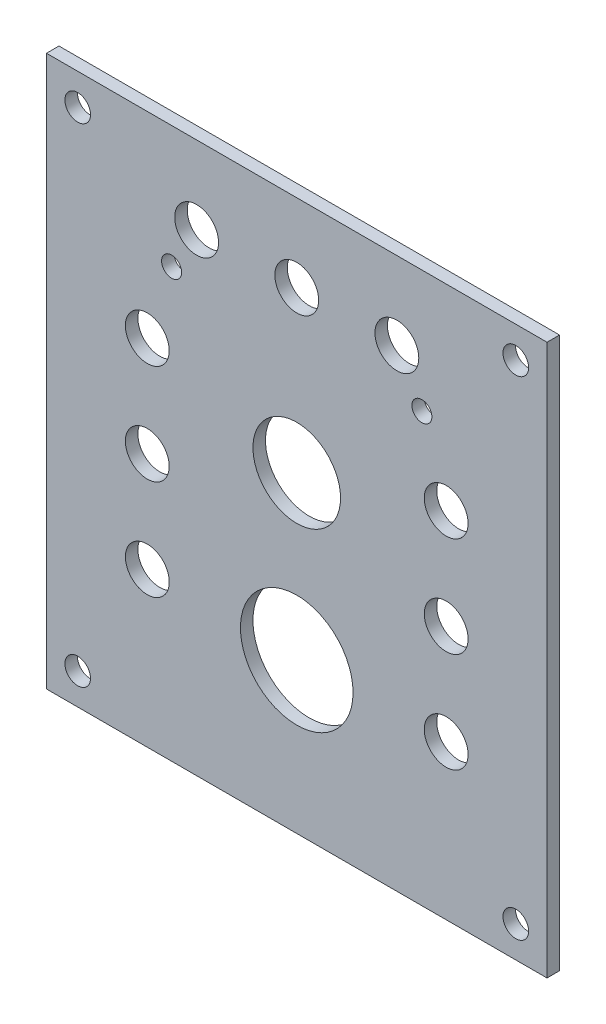
ISO-10303-21;
HEADER;
FILE_DESCRIPTION(('STEP AP214'),'2;1');
FILE_NAME('part.step','',(''),(''),'','','');
FILE_SCHEMA(('AUTOMOTIVE_DESIGN { 1 0 10303 214 1 1 1 1 }'));
ENDSEC;
DATA;
#1=APPLICATION_CONTEXT('core data for automotive mechanical design processes');
#2=APPLICATION_PROTOCOL_DEFINITION('international standard','automotive_design',2000,#1);
#3=PRODUCT_CONTEXT('',#1,'mechanical');
#4=PRODUCT('Part','Part','',(#3));
#5=PRODUCT_RELATED_PRODUCT_CATEGORY('part','',(#4));
#6=PRODUCT_DEFINITION_FORMATION('','',#4);
#7=PRODUCT_DEFINITION_CONTEXT('part definition',#1,'design');
#8=PRODUCT_DEFINITION('design','',#6,#7);
#9=PRODUCT_DEFINITION_SHAPE('','',#8);
#10=(LENGTH_UNIT() NAMED_UNIT(*) SI_UNIT(.MILLI.,.METRE.));
#11=(NAMED_UNIT(*) PLANE_ANGLE_UNIT() SI_UNIT($,.RADIAN.));
#12=(NAMED_UNIT(*) SI_UNIT($,.STERADIAN.) SOLID_ANGLE_UNIT());
#13=UNCERTAINTY_MEASURE_WITH_UNIT(LENGTH_MEASURE(1.E-05),#10,'distance_accuracy_value','');
#14=(GEOMETRIC_REPRESENTATION_CONTEXT(3) GLOBAL_UNCERTAINTY_ASSIGNED_CONTEXT((#13)) GLOBAL_UNIT_ASSIGNED_CONTEXT((#10,
#11,#12)) REPRESENTATION_CONTEXT('',''));
#15=CARTESIAN_POINT('',(0.,0.,0.));
#16=DIRECTION('',(0.,0.,1.));
#17=DIRECTION('',(1.,0.,0.));
#18=AXIS2_PLACEMENT_3D('',#15,#16,#17);
#19=CARTESIAN_POINT('',(63.5,101.6,-3.175));
#20=DIRECTION('',(0.,0.,-1.));
#21=DIRECTION('',(-1.,0.,0.));
#22=AXIS2_PLACEMENT_3D('',#19,#20,#21);
#23=PLANE('',#22);
#24=CARTESIAN_POINT('',(-55.5752000000001,-30.1752,-3.175));
#25=DIRECTION('',(0.,0.,1.));
#26=DIRECTION('',(1.,0.,0.));
#27=AXIS2_PLACEMENT_3D('',#24,#25,#26);
#28=CIRCLE('',#27,3.2512);
#29=CARTESIAN_POINT('',(-52.3240000000001,-30.1752,-3.175));
#30=VERTEX_POINT('',#29);
#31=EDGE_CURVE('E129',#30,#30,#28,.T.);
#32=ORIENTED_EDGE('',*,*,#31,.T.);
#33=EDGE_LOOP('',(#32));
#34=FACE_BOUND('',#33,.T.);
#35=CARTESIAN_POINT('',(0.,81.8388,-3.175));
#36=DIRECTION('',(0.,0.,1.));
#37=DIRECTION('',(1.,0.,0.));
#38=AXIS2_PLACEMENT_3D('',#35,#36,#37);
#39=CIRCLE('',#38,5.5626);
#40=CARTESIAN_POINT('',(5.5626,81.8388,-3.175));
#41=VERTEX_POINT('',#40);
#42=EDGE_CURVE('E132',#41,#41,#39,.T.);
#43=ORIENTED_EDGE('',*,*,#42,.T.);
#44=EDGE_LOOP('',(#43));
#45=FACE_BOUND('',#44,.T.);
#46=CARTESIAN_POINT('',(-37.9152217386642,51.7771785892618,-3.175));
#47=DIRECTION('',(0.,0.,1.));
#48=DIRECTION('',(1.,0.,0.));
#49=AXIS2_PLACEMENT_3D('',#46,#47,#48);
#50=CIRCLE('',#49,5.5626);
#51=CARTESIAN_POINT('',(-32.3526217386642,51.7771785892618,-3.175));
#52=VERTEX_POINT('',#51);
#53=EDGE_CURVE('E135',#52,#52,#50,.T.);
#54=ORIENTED_EDGE('',*,*,#53,.T.);
#55=EDGE_LOOP('',(#54));
#56=FACE_BOUND('',#55,.T.);
#57=CARTESIAN_POINT('',(37.9152217386642,0.977178589261784,-3.175));
#58=DIRECTION('',(0.,0.,1.));
#59=DIRECTION('',(1.,0.,0.));
#60=AXIS2_PLACEMENT_3D('',#57,#58,#59);
#61=CIRCLE('',#60,5.5626);
#62=CARTESIAN_POINT('',(43.4778217386642,0.977178589261784,-3.175));
#63=VERTEX_POINT('',#62);
#64=EDGE_CURVE('E138',#63,#63,#61,.T.);
#65=ORIENTED_EDGE('',*,*,#64,.T.);
#66=EDGE_LOOP('',(#65));
#67=FACE_BOUND('',#66,.T.);
#68=CARTESIAN_POINT('',(25.4,81.8388,-3.175));
#69=DIRECTION('',(0.,0.,1.));
#70=DIRECTION('',(1.,0.,0.));
#71=AXIS2_PLACEMENT_3D('',#68,#69,#70);
#72=CIRCLE('',#71,5.5626);
#73=CARTESIAN_POINT('',(30.9626,81.8388,-3.175));
#74=VERTEX_POINT('',#73);
#75=EDGE_CURVE('E141',#74,#74,#72,.T.);
#76=ORIENTED_EDGE('',*,*,#75,.T.);
#77=EDGE_LOOP('',(#76));
#78=FACE_BOUND('',#77,.T.);
#79=CARTESIAN_POINT('',(0.,41.148,-3.175));
#80=DIRECTION('',(0.,0.,1.));
#81=DIRECTION('',(1.,0.,0.));
#82=AXIS2_PLACEMENT_3D('',#79,#80,#81);
#83=CIRCLE('',#82,11.1125);
#84=CARTESIAN_POINT('',(11.1125,41.148,-3.175));
#85=VERTEX_POINT('',#84);
#86=EDGE_CURVE('E144',#85,#85,#83,.T.);
#87=ORIENTED_EDGE('',*,*,#86,.T.);
#88=EDGE_LOOP('',(#87));
#89=FACE_BOUND('',#88,.T.);
#90=CARTESIAN_POINT('',(55.5752,93.6752,-3.175));
#91=DIRECTION('',(0.,0.,1.));
#92=DIRECTION('',(1.,0.,0.));
#93=AXIS2_PLACEMENT_3D('',#90,#91,#92);
#94=CIRCLE('',#93,3.25119999999999);
#95=CARTESIAN_POINT('',(58.8264,93.6752,-3.175));
#96=VERTEX_POINT('',#95);
#97=EDGE_CURVE('E147',#96,#96,#94,.T.);
#98=ORIENTED_EDGE('',*,*,#97,.T.);
#99=EDGE_LOOP('',(#98));
#100=FACE_BOUND('',#99,.T.);
#101=CARTESIAN_POINT('',(55.5752,-30.1752,-3.175));
#102=DIRECTION('',(0.,0.,1.));
#103=DIRECTION('',(1.,0.,0.));
#104=AXIS2_PLACEMENT_3D('',#101,#102,#103);
#105=CIRCLE('',#104,3.2512);
#106=CARTESIAN_POINT('',(58.8264,-30.1752,-3.175));
#107=VERTEX_POINT('',#106);
#108=EDGE_CURVE('E150',#107,#107,#105,.T.);
#109=ORIENTED_EDGE('',*,*,#108,.T.);
#110=EDGE_LOOP('',(#109));
#111=FACE_BOUND('',#110,.T.);
#112=DIRECTION('',(-1.,0.,0.));
#113=VECTOR('',#112,1.);
#114=CARTESIAN_POINT('',(63.5,-38.1,-3.175));
#115=LINE('',#114,#113);
#116=CARTESIAN_POINT('',(63.5,-38.1,-3.175));
#117=VERTEX_POINT('',#116);
#118=CARTESIAN_POINT('',(-63.5,-38.1,-3.175));
#119=VERTEX_POINT('',#118);
#120=EDGE_CURVE('E55',#117,#119,#115,.T.);
#121=ORIENTED_EDGE('',*,*,#120,.T.);
#122=DIRECTION('',(0.,1.,0.));
#123=VECTOR('',#122,1.);
#124=CARTESIAN_POINT('',(-63.5,-38.1,-3.175));
#125=LINE('',#124,#123);
#126=CARTESIAN_POINT('',(-63.5,101.6,-3.175));
#127=VERTEX_POINT('',#126);
#128=EDGE_CURVE('E481',#119,#127,#125,.T.);
#129=ORIENTED_EDGE('',*,*,#128,.T.);
#130=DIRECTION('',(1.,0.,0.));
#131=VECTOR('',#130,1.);
#132=CARTESIAN_POINT('',(-63.5,101.6,-3.175));
#133=LINE('',#132,#131);
#134=CARTESIAN_POINT('',(63.5,101.6,-3.175));
#135=VERTEX_POINT('',#134);
#136=EDGE_CURVE('E60',#127,#135,#133,.T.);
#137=ORIENTED_EDGE('',*,*,#136,.T.);
#138=DIRECTION('',(0.,-1.,0.));
#139=VECTOR('',#138,1.);
#140=CARTESIAN_POINT('',(63.5,101.6,-3.175));
#141=LINE('',#140,#139);
#142=EDGE_CURVE('E58',#135,#117,#141,.T.);
#143=ORIENTED_EDGE('',*,*,#142,.T.);
#144=EDGE_LOOP('',(#121,#129,#137,#143));
#145=FACE_BOUND('',#144,.T.);
#146=CARTESIAN_POINT('',(-55.5752,93.6752,-3.175));
#147=DIRECTION('',(0.,0.,1.));
#148=DIRECTION('',(1.,0.,0.));
#149=AXIS2_PLACEMENT_3D('',#146,#147,#148);
#150=CIRCLE('',#149,3.2512);
#151=CARTESIAN_POINT('',(-52.324,93.6752,-3.175));
#152=VERTEX_POINT('',#151);
#153=EDGE_CURVE('E66',#152,#152,#150,.T.);
#154=ORIENTED_EDGE('',*,*,#153,.T.);
#155=EDGE_LOOP('',(#154));
#156=FACE_BOUND('',#155,.T.);
#157=CARTESIAN_POINT('',(0.,0.,-3.175));
#158=DIRECTION('',(0.,0.,1.));
#159=DIRECTION('',(1.,0.,0.));
#160=AXIS2_PLACEMENT_3D('',#157,#158,#159);
#161=CIRCLE('',#160,14.2875);
#162=CARTESIAN_POINT('',(14.2875,0.,-3.175));
#163=VERTEX_POINT('',#162);
#164=EDGE_CURVE('E156',#163,#163,#161,.T.);
#165=ORIENTED_EDGE('',*,*,#164,.T.);
#166=EDGE_LOOP('',(#165));
#167=FACE_BOUND('',#166,.T.);
#168=CARTESIAN_POINT('',(-25.4,81.8388,-3.175));
#169=DIRECTION('',(0.,0.,1.));
#170=DIRECTION('',(1.,0.,0.));
#171=AXIS2_PLACEMENT_3D('',#168,#169,#170);
#172=CIRCLE('',#171,5.5626);
#173=CARTESIAN_POINT('',(-19.8374,81.8388,-3.175));
#174=VERTEX_POINT('',#173);
#175=EDGE_CURVE('E159',#174,#174,#172,.T.);
#176=ORIENTED_EDGE('',*,*,#175,.T.);
#177=EDGE_LOOP('',(#176));
#178=FACE_BOUND('',#177,.T.);
#179=CARTESIAN_POINT('',(37.9152217386642,51.7771785892618,-3.175));
#180=DIRECTION('',(0.,0.,1.));
#181=DIRECTION('',(1.,0.,0.));
#182=AXIS2_PLACEMENT_3D('',#179,#180,#181);
#183=CIRCLE('',#182,5.56260000000001);
#184=CARTESIAN_POINT('',(43.4778217386643,51.7771785892618,-3.175));
#185=VERTEX_POINT('',#184);
#186=EDGE_CURVE('E162',#185,#185,#183,.T.);
#187=ORIENTED_EDGE('',*,*,#186,.T.);
#188=EDGE_LOOP('',(#187));
#189=FACE_BOUND('',#188,.T.);
#190=CARTESIAN_POINT('',(-37.9152217386642,0.977178589261808,-3.175));
#191=DIRECTION('',(0.,0.,1.));
#192=DIRECTION('',(1.,0.,0.));
#193=AXIS2_PLACEMENT_3D('',#190,#191,#192);
#194=CIRCLE('',#193,5.5626);
#195=CARTESIAN_POINT('',(-32.3526217386642,0.977178589261808,-3.175));
#196=VERTEX_POINT('',#195);
#197=EDGE_CURVE('E165',#196,#196,#194,.T.);
#198=ORIENTED_EDGE('',*,*,#197,.T.);
#199=EDGE_LOOP('',(#198));
#200=FACE_BOUND('',#199,.T.);
#201=CARTESIAN_POINT('',(-37.9152217386642,26.3771785892618,-3.175));
#202=DIRECTION('',(0.,0.,1.));
#203=DIRECTION('',(1.,0.,0.));
#204=AXIS2_PLACEMENT_3D('',#201,#202,#203);
#205=CIRCLE('',#204,5.5626);
#206=CARTESIAN_POINT('',(-32.3526217386642,26.3771785892618,-3.175));
#207=VERTEX_POINT('',#206);
#208=EDGE_CURVE('E168',#207,#207,#205,.T.);
#209=ORIENTED_EDGE('',*,*,#208,.T.);
#210=EDGE_LOOP('',(#209));
#211=FACE_BOUND('',#210,.T.);
#212=CARTESIAN_POINT('',(37.9152217386642,26.3771785892618,-3.175));
#213=DIRECTION('',(0.,0.,1.));
#214=DIRECTION('',(1.,0.,0.));
#215=AXIS2_PLACEMENT_3D('',#212,#213,#214);
#216=CIRCLE('',#215,5.5626);
#217=CARTESIAN_POINT('',(43.4778217386642,26.3771785892618,-3.175));
#218=VERTEX_POINT('',#217);
#219=EDGE_CURVE('E171',#218,#218,#216,.T.);
#220=ORIENTED_EDGE('',*,*,#219,.T.);
#221=EDGE_LOOP('',(#220));
#222=FACE_BOUND('',#221,.T.);
#223=CARTESIAN_POINT('',(-31.75,70.58025,-3.175));
#224=DIRECTION('',(0.,0.,1.));
#225=DIRECTION('',(1.,0.,0.));
#226=AXIS2_PLACEMENT_3D('',#223,#224,#225);
#227=CIRCLE('',#226,2.54);
#228=CARTESIAN_POINT('',(-29.21,70.58025,-3.175));
#229=VERTEX_POINT('',#228);
#230=EDGE_CURVE('E173',#229,#229,#227,.T.);
#231=ORIENTED_EDGE('',*,*,#230,.T.);
#232=EDGE_LOOP('',(#231));
#233=FACE_BOUND('',#232,.T.);
#234=CARTESIAN_POINT('',(31.75,70.58025,-3.175));
#235=DIRECTION('',(0.,0.,1.));
#236=DIRECTION('',(1.,0.,0.));
#237=AXIS2_PLACEMENT_3D('',#234,#235,#236);
#238=CIRCLE('',#237,2.54);
#239=CARTESIAN_POINT('',(34.29,70.58025,-3.175));
#240=VERTEX_POINT('',#239);
#241=EDGE_CURVE('E19',#240,#240,#238,.T.);
#242=ORIENTED_EDGE('',*,*,#241,.T.);
#243=EDGE_LOOP('',(#242));
#244=FACE_BOUND('',#243,.T.);
#245=ADVANCED_FACE('F16',(#34,#45,#56,#67,#78,#89,#100,#111,#145,#156,#167,#178,#189,#200,#211,
#222,#233,#244),#23,.T.);
#246=CARTESIAN_POINT('',(31.75,70.58025,-3.175));
#247=DIRECTION('',(0.,0.,1.));
#248=DIRECTION('',(1.,0.,0.));
#249=AXIS2_PLACEMENT_3D('',#246,#247,#248);
#250=CYLINDRICAL_SURFACE('',#249,2.54);
#251=ORIENTED_EDGE('',*,*,#241,.F.);
#252=EDGE_LOOP('',(#251));
#253=FACE_BOUND('',#252,.T.);
#254=CARTESIAN_POINT('',(31.75,70.58025,0.));
#255=DIRECTION('',(0.,0.,1.));
#256=DIRECTION('',(1.,0.,0.));
#257=AXIS2_PLACEMENT_3D('',#254,#255,#256);
#258=CIRCLE('',#257,2.54);
#259=CARTESIAN_POINT('',(34.29,70.58025,0.));
#260=VERTEX_POINT('',#259);
#261=EDGE_CURVE('E126',#260,#260,#258,.T.);
#262=ORIENTED_EDGE('',*,*,#261,.T.);
#263=EDGE_LOOP('',(#262));
#264=FACE_BOUND('',#263,.T.);
#265=ADVANCED_FACE('F181',(#253,#264),#250,.F.);
#266=CARTESIAN_POINT('',(-31.75,70.58025,-3.175));
#267=DIRECTION('',(0.,0.,1.));
#268=DIRECTION('',(1.,0.,0.));
#269=AXIS2_PLACEMENT_3D('',#266,#267,#268);
#270=CYLINDRICAL_SURFACE('',#269,2.54);
#271=ORIENTED_EDGE('',*,*,#230,.F.);
#272=EDGE_LOOP('',(#271));
#273=FACE_BOUND('',#272,.T.);
#274=CARTESIAN_POINT('',(-31.75,70.58025,0.));
#275=DIRECTION('',(0.,0.,1.));
#276=DIRECTION('',(1.,0.,0.));
#277=AXIS2_PLACEMENT_3D('',#274,#275,#276);
#278=CIRCLE('',#277,2.54);
#279=CARTESIAN_POINT('',(-29.21,70.58025,0.));
#280=VERTEX_POINT('',#279);
#281=EDGE_CURVE('E123',#280,#280,#278,.T.);
#282=ORIENTED_EDGE('',*,*,#281,.T.);
#283=EDGE_LOOP('',(#282));
#284=FACE_BOUND('',#283,.T.);
#285=ADVANCED_FACE('F184',(#273,#284),#270,.F.);
#286=CARTESIAN_POINT('',(37.9152217386642,26.3771785892618,-3.175));
#287=DIRECTION('',(0.,0.,1.));
#288=DIRECTION('',(1.,0.,0.));
#289=AXIS2_PLACEMENT_3D('',#286,#287,#288);
#290=CYLINDRICAL_SURFACE('',#289,5.5626);
#291=CARTESIAN_POINT('',(37.9152217386642,26.3771785892618,0.));
#292=DIRECTION('',(0.,0.,1.));
#293=DIRECTION('',(1.,0.,0.));
#294=AXIS2_PLACEMENT_3D('',#291,#292,#293);
#295=CIRCLE('',#294,5.5626);
#296=CARTESIAN_POINT('',(43.4778217386642,26.3771785892618,0.));
#297=VERTEX_POINT('',#296);
#298=EDGE_CURVE('E120',#297,#297,#295,.T.);
#299=ORIENTED_EDGE('',*,*,#298,.T.);
#300=EDGE_LOOP('',(#299));
#301=FACE_BOUND('',#300,.T.);
#302=ORIENTED_EDGE('',*,*,#219,.F.);
#303=EDGE_LOOP('',(#302));
#304=FACE_BOUND('',#303,.T.);
#305=ADVANCED_FACE('F263',(#301,#304),#290,.F.);
#306=CARTESIAN_POINT('',(-37.9152217386642,26.3771785892618,-3.175));
#307=DIRECTION('',(0.,0.,1.));
#308=DIRECTION('',(1.,0.,0.));
#309=AXIS2_PLACEMENT_3D('',#306,#307,#308);
#310=CYLINDRICAL_SURFACE('',#309,5.5626);
#311=CARTESIAN_POINT('',(-37.9152217386642,26.3771785892618,0.));
#312=DIRECTION('',(0.,0.,1.));
#313=DIRECTION('',(1.,0.,0.));
#314=AXIS2_PLACEMENT_3D('',#311,#312,#313);
#315=CIRCLE('',#314,5.5626);
#316=CARTESIAN_POINT('',(-32.3526217386642,26.3771785892618,0.));
#317=VERTEX_POINT('',#316);
#318=EDGE_CURVE('E117',#317,#317,#315,.T.);
#319=ORIENTED_EDGE('',*,*,#318,.T.);
#320=EDGE_LOOP('',(#319));
#321=FACE_BOUND('',#320,.T.);
#322=ORIENTED_EDGE('',*,*,#208,.F.);
#323=EDGE_LOOP('',(#322));
#324=FACE_BOUND('',#323,.T.);
#325=ADVANCED_FACE('F259',(#321,#324),#310,.F.);
#326=CARTESIAN_POINT('',(-37.9152217386642,0.977178589261808,-3.175));
#327=DIRECTION('',(0.,0.,1.));
#328=DIRECTION('',(1.,0.,0.));
#329=AXIS2_PLACEMENT_3D('',#326,#327,#328);
#330=CYLINDRICAL_SURFACE('',#329,5.5626);
#331=CARTESIAN_POINT('',(-37.9152217386642,0.977178589261808,0.));
#332=DIRECTION('',(0.,0.,1.));
#333=DIRECTION('',(1.,0.,0.));
#334=AXIS2_PLACEMENT_3D('',#331,#332,#333);
#335=CIRCLE('',#334,5.5626);
#336=CARTESIAN_POINT('',(-32.3526217386642,0.977178589261808,0.));
#337=VERTEX_POINT('',#336);
#338=EDGE_CURVE('E114',#337,#337,#335,.T.);
#339=ORIENTED_EDGE('',*,*,#338,.T.);
#340=EDGE_LOOP('',(#339));
#341=FACE_BOUND('',#340,.T.);
#342=ORIENTED_EDGE('',*,*,#197,.F.);
#343=EDGE_LOOP('',(#342));
#344=FACE_BOUND('',#343,.T.);
#345=ADVANCED_FACE('F255',(#341,#344),#330,.F.);
#346=CARTESIAN_POINT('',(37.9152217386642,51.7771785892618,-3.175));
#347=DIRECTION('',(0.,0.,1.));
#348=DIRECTION('',(1.,0.,0.));
#349=AXIS2_PLACEMENT_3D('',#346,#347,#348);
#350=CYLINDRICAL_SURFACE('',#349,5.56260000000001);
#351=CARTESIAN_POINT('',(37.9152217386642,51.7771785892618,0.));
#352=DIRECTION('',(0.,0.,1.));
#353=DIRECTION('',(1.,0.,0.));
#354=AXIS2_PLACEMENT_3D('',#351,#352,#353);
#355=CIRCLE('',#354,5.56260000000001);
#356=CARTESIAN_POINT('',(43.4778217386643,51.7771785892618,0.));
#357=VERTEX_POINT('',#356);
#358=EDGE_CURVE('E111',#357,#357,#355,.T.);
#359=ORIENTED_EDGE('',*,*,#358,.T.);
#360=EDGE_LOOP('',(#359));
#361=FACE_BOUND('',#360,.T.);
#362=ORIENTED_EDGE('',*,*,#186,.F.);
#363=EDGE_LOOP('',(#362));
#364=FACE_BOUND('',#363,.T.);
#365=ADVANCED_FACE('F251',(#361,#364),#350,.F.);
#366=CARTESIAN_POINT('',(-25.4,81.8388,-3.175));
#367=DIRECTION('',(0.,0.,1.));
#368=DIRECTION('',(1.,0.,0.));
#369=AXIS2_PLACEMENT_3D('',#366,#367,#368);
#370=CYLINDRICAL_SURFACE('',#369,5.5626);
#371=CARTESIAN_POINT('',(-25.4,81.8388,0.));
#372=DIRECTION('',(0.,0.,1.));
#373=DIRECTION('',(1.,0.,0.));
#374=AXIS2_PLACEMENT_3D('',#371,#372,#373);
#375=CIRCLE('',#374,5.5626);
#376=CARTESIAN_POINT('',(-19.8374,81.8388,0.));
#377=VERTEX_POINT('',#376);
#378=EDGE_CURVE('E108',#377,#377,#375,.T.);
#379=ORIENTED_EDGE('',*,*,#378,.T.);
#380=EDGE_LOOP('',(#379));
#381=FACE_BOUND('',#380,.T.);
#382=ORIENTED_EDGE('',*,*,#175,.F.);
#383=EDGE_LOOP('',(#382));
#384=FACE_BOUND('',#383,.T.);
#385=ADVANCED_FACE('F247',(#381,#384),#370,.F.);
#386=CARTESIAN_POINT('',(0.,0.,-3.175));
#387=DIRECTION('',(0.,0.,1.));
#388=DIRECTION('',(1.,0.,0.));
#389=AXIS2_PLACEMENT_3D('',#386,#387,#388);
#390=CYLINDRICAL_SURFACE('',#389,14.2875);
#391=CARTESIAN_POINT('',(0.,0.,0.));
#392=DIRECTION('',(0.,0.,1.));
#393=DIRECTION('',(1.,0.,0.));
#394=AXIS2_PLACEMENT_3D('',#391,#392,#393);
#395=CIRCLE('',#394,14.2875);
#396=CARTESIAN_POINT('',(14.2875,0.,0.));
#397=VERTEX_POINT('',#396);
#398=EDGE_CURVE('E105',#397,#397,#395,.T.);
#399=ORIENTED_EDGE('',*,*,#398,.T.);
#400=EDGE_LOOP('',(#399));
#401=FACE_BOUND('',#400,.T.);
#402=ORIENTED_EDGE('',*,*,#164,.F.);
#403=EDGE_LOOP('',(#402));
#404=FACE_BOUND('',#403,.T.);
#405=ADVANCED_FACE('F243',(#401,#404),#390,.F.);
#406=CARTESIAN_POINT('',(-55.5752,93.6752,-3.175));
#407=DIRECTION('',(0.,0.,1.));
#408=DIRECTION('',(1.,0.,0.));
#409=AXIS2_PLACEMENT_3D('',#406,#407,#408);
#410=CYLINDRICAL_SURFACE('',#409,3.2512);
#411=CARTESIAN_POINT('',(-55.5752,93.6752,0.));
#412=DIRECTION('',(0.,0.,1.));
#413=DIRECTION('',(1.,0.,0.));
#414=AXIS2_PLACEMENT_3D('',#411,#412,#413);
#415=CIRCLE('',#414,3.2512);
#416=CARTESIAN_POINT('',(-52.324,93.6752,0.));
#417=VERTEX_POINT('',#416);
#418=EDGE_CURVE('E102',#417,#417,#415,.T.);
#419=ORIENTED_EDGE('',*,*,#418,.T.);
#420=EDGE_LOOP('',(#419));
#421=FACE_BOUND('',#420,.T.);
#422=ORIENTED_EDGE('',*,*,#153,.F.);
#423=EDGE_LOOP('',(#422));
#424=FACE_BOUND('',#423,.T.);
#425=ADVANCED_FACE('F240',(#421,#424),#410,.F.);
#426=CARTESIAN_POINT('',(63.5,101.6,-3.175));
#427=DIRECTION('',(-1.,0.,0.));
#428=DIRECTION('',(0.,-1.,0.));
#429=AXIS2_PLACEMENT_3D('',#426,#427,#428);
#430=PLANE('',#429);
#431=DIRECTION('',(0.,0.,1.));
#432=VECTOR('',#431,1.);
#433=CARTESIAN_POINT('',(63.5,-38.1,-3.175));
#434=LINE('',#433,#432);
#435=CARTESIAN_POINT('',(63.5,-38.1,0.));
#436=VERTEX_POINT('',#435);
#437=EDGE_CURVE('E65',#436,#117,#434,.F.);
#438=ORIENTED_EDGE('',*,*,#437,.T.);
#439=ORIENTED_EDGE('',*,*,#142,.F.);
#440=DIRECTION('',(0.,0.,1.));
#441=VECTOR('',#440,1.);
#442=CARTESIAN_POINT('',(63.5,101.6,-3.175));
#443=LINE('',#442,#441);
#444=CARTESIAN_POINT('',(63.5,101.6,0.));
#445=VERTEX_POINT('',#444);
#446=EDGE_CURVE('E153',#135,#445,#443,.T.);
#447=ORIENTED_EDGE('',*,*,#446,.T.);
#448=DIRECTION('',(0.,1.,0.));
#449=VECTOR('',#448,1.);
#450=CARTESIAN_POINT('',(63.5,101.6,0.));
#451=LINE('',#450,#449);
#452=EDGE_CURVE('E77',#445,#436,#451,.F.);
#453=ORIENTED_EDGE('',*,*,#452,.T.);
#454=EDGE_LOOP('',(#438,#439,#447,#453));
#455=FACE_BOUND('',#454,.T.);
#456=ADVANCED_FACE('F76',(#455),#430,.F.);
#457=CARTESIAN_POINT('',(63.5,-38.1,-3.175));
#458=DIRECTION('',(0.,1.,0.));
#459=DIRECTION('',(-1.,0.,0.));
#460=AXIS2_PLACEMENT_3D('',#457,#458,#459);
#461=PLANE('',#460);
#462=DIRECTION('',(0.,0.,1.));
#463=VECTOR('',#462,1.);
#464=CARTESIAN_POINT('',(-63.5,-38.1,-3.175));
#465=LINE('',#464,#463);
#466=CARTESIAN_POINT('',(-63.5,-38.1,0.));
#467=VERTEX_POINT('',#466);
#468=EDGE_CURVE('E73',#467,#119,#465,.F.);
#469=ORIENTED_EDGE('',*,*,#468,.T.);
#470=ORIENTED_EDGE('',*,*,#120,.F.);
#471=ORIENTED_EDGE('',*,*,#437,.F.);
#472=DIRECTION('',(-1.,0.,0.));
#473=VECTOR('',#472,1.);
#474=CARTESIAN_POINT('',(63.5,-38.1,0.));
#475=LINE('',#474,#473);
#476=EDGE_CURVE('E490',#436,#467,#475,.T.);
#477=ORIENTED_EDGE('',*,*,#476,.T.);
#478=EDGE_LOOP('',(#469,#470,#471,#477));
#479=FACE_BOUND('',#478,.T.);
#480=ADVANCED_FACE('F70',(#479),#461,.F.);
#481=CARTESIAN_POINT('',(-63.5,-38.1,-3.175));
#482=DIRECTION('',(1.,0.,0.));
#483=DIRECTION('',(0.,1.,0.));
#484=AXIS2_PLACEMENT_3D('',#481,#482,#483);
#485=PLANE('',#484);
#486=DIRECTION('',(0.,0.,1.));
#487=VECTOR('',#486,1.);
#488=CARTESIAN_POINT('',(-63.5,101.6,-3.175));
#489=LINE('',#488,#487);
#490=CARTESIAN_POINT('',(-63.5,101.6,0.));
#491=VERTEX_POINT('',#490);
#492=EDGE_CURVE('E34',#491,#127,#489,.F.);
#493=ORIENTED_EDGE('',*,*,#492,.T.);
#494=ORIENTED_EDGE('',*,*,#128,.F.);
#495=ORIENTED_EDGE('',*,*,#468,.F.);
#496=DIRECTION('',(0.,1.,0.));
#497=VECTOR('',#496,1.);
#498=CARTESIAN_POINT('',(-63.5,101.6,0.));
#499=LINE('',#498,#497);
#500=EDGE_CURVE('E483',#467,#491,#499,.T.);
#501=ORIENTED_EDGE('',*,*,#500,.T.);
#502=EDGE_LOOP('',(#493,#494,#495,#501));
#503=FACE_BOUND('',#502,.T.);
#504=ADVANCED_FACE('F232',(#503),#485,.F.);
#505=CARTESIAN_POINT('',(-63.5,101.6,-3.175));
#506=DIRECTION('',(0.,-1.,0.));
#507=DIRECTION('',(1.,0.,0.));
#508=AXIS2_PLACEMENT_3D('',#505,#506,#507);
#509=PLANE('',#508);
#510=ORIENTED_EDGE('',*,*,#446,.F.);
#511=ORIENTED_EDGE('',*,*,#136,.F.);
#512=ORIENTED_EDGE('',*,*,#492,.F.);
#513=DIRECTION('',(-1.,0.,0.));
#514=VECTOR('',#513,1.);
#515=CARTESIAN_POINT('',(63.5,101.6,0.));
#516=LINE('',#515,#514);
#517=EDGE_CURVE('E101',#491,#445,#516,.F.);
#518=ORIENTED_EDGE('',*,*,#517,.T.);
#519=EDGE_LOOP('',(#510,#511,#512,#518));
#520=FACE_BOUND('',#519,.T.);
#521=ADVANCED_FACE('F228',(#520),#509,.F.);
#522=CARTESIAN_POINT('',(55.5752,-30.1752,-3.175));
#523=DIRECTION('',(0.,0.,1.));
#524=DIRECTION('',(1.,0.,0.));
#525=AXIS2_PLACEMENT_3D('',#522,#523,#524);
#526=CYLINDRICAL_SURFACE('',#525,3.2512);
#527=CARTESIAN_POINT('',(55.5752,-30.1752,0.));
#528=DIRECTION('',(0.,0.,1.));
#529=DIRECTION('',(1.,0.,0.));
#530=AXIS2_PLACEMENT_3D('',#527,#528,#529);
#531=CIRCLE('',#530,3.2512);
#532=CARTESIAN_POINT('',(58.8264,-30.1752,0.));
#533=VERTEX_POINT('',#532);
#534=EDGE_CURVE('E98',#533,#533,#531,.T.);
#535=ORIENTED_EDGE('',*,*,#534,.T.);
#536=EDGE_LOOP('',(#535));
#537=FACE_BOUND('',#536,.T.);
#538=ORIENTED_EDGE('',*,*,#108,.F.);
#539=EDGE_LOOP('',(#538));
#540=FACE_BOUND('',#539,.T.);
#541=ADVANCED_FACE('F224',(#537,#540),#526,.F.);
#542=CARTESIAN_POINT('',(55.5752,93.6752,-3.175));
#543=DIRECTION('',(0.,0.,1.));
#544=DIRECTION('',(1.,0.,0.));
#545=AXIS2_PLACEMENT_3D('',#542,#543,#544);
#546=CYLINDRICAL_SURFACE('',#545,3.25119999999999);
#547=CARTESIAN_POINT('',(55.5752,93.6752,0.));
#548=DIRECTION('',(0.,0.,1.));
#549=DIRECTION('',(1.,0.,0.));
#550=AXIS2_PLACEMENT_3D('',#547,#548,#549);
#551=CIRCLE('',#550,3.25119999999999);
#552=CARTESIAN_POINT('',(58.8264,93.6752,0.));
#553=VERTEX_POINT('',#552);
#554=EDGE_CURVE('E95',#553,#553,#551,.T.);
#555=ORIENTED_EDGE('',*,*,#554,.T.);
#556=EDGE_LOOP('',(#555));
#557=FACE_BOUND('',#556,.T.);
#558=ORIENTED_EDGE('',*,*,#97,.F.);
#559=EDGE_LOOP('',(#558));
#560=FACE_BOUND('',#559,.T.);
#561=ADVANCED_FACE('F220',(#557,#560),#546,.F.);
#562=CARTESIAN_POINT('',(0.,41.148,-3.175));
#563=DIRECTION('',(0.,0.,1.));
#564=DIRECTION('',(1.,0.,0.));
#565=AXIS2_PLACEMENT_3D('',#562,#563,#564);
#566=CYLINDRICAL_SURFACE('',#565,11.1125);
#567=CARTESIAN_POINT('',(0.,41.148,0.));
#568=DIRECTION('',(0.,0.,1.));
#569=DIRECTION('',(1.,0.,0.));
#570=AXIS2_PLACEMENT_3D('',#567,#568,#569);
#571=CIRCLE('',#570,11.1125);
#572=CARTESIAN_POINT('',(11.1125,41.148,0.));
#573=VERTEX_POINT('',#572);
#574=EDGE_CURVE('E92',#573,#573,#571,.T.);
#575=ORIENTED_EDGE('',*,*,#574,.T.);
#576=EDGE_LOOP('',(#575));
#577=FACE_BOUND('',#576,.T.);
#578=ORIENTED_EDGE('',*,*,#86,.F.);
#579=EDGE_LOOP('',(#578));
#580=FACE_BOUND('',#579,.T.);
#581=ADVANCED_FACE('F216',(#577,#580),#566,.F.);
#582=CARTESIAN_POINT('',(25.4,81.8388,-3.175));
#583=DIRECTION('',(0.,0.,1.));
#584=DIRECTION('',(1.,0.,0.));
#585=AXIS2_PLACEMENT_3D('',#582,#583,#584);
#586=CYLINDRICAL_SURFACE('',#585,5.5626);
#587=CARTESIAN_POINT('',(25.4,81.8388,0.));
#588=DIRECTION('',(0.,0.,1.));
#589=DIRECTION('',(1.,0.,0.));
#590=AXIS2_PLACEMENT_3D('',#587,#588,#589);
#591=CIRCLE('',#590,5.5626);
#592=CARTESIAN_POINT('',(30.9626,81.8388,0.));
#593=VERTEX_POINT('',#592);
#594=EDGE_CURVE('E89',#593,#593,#591,.T.);
#595=ORIENTED_EDGE('',*,*,#594,.T.);
#596=EDGE_LOOP('',(#595));
#597=FACE_BOUND('',#596,.T.);
#598=ORIENTED_EDGE('',*,*,#75,.F.);
#599=EDGE_LOOP('',(#598));
#600=FACE_BOUND('',#599,.T.);
#601=ADVANCED_FACE('F212',(#597,#600),#586,.F.);
#602=CARTESIAN_POINT('',(37.9152217386642,0.977178589261784,-3.175));
#603=DIRECTION('',(0.,0.,1.));
#604=DIRECTION('',(1.,0.,0.));
#605=AXIS2_PLACEMENT_3D('',#602,#603,#604);
#606=CYLINDRICAL_SURFACE('',#605,5.5626);
#607=CARTESIAN_POINT('',(37.9152217386642,0.977178589261784,0.));
#608=DIRECTION('',(0.,0.,1.));
#609=DIRECTION('',(1.,0.,0.));
#610=AXIS2_PLACEMENT_3D('',#607,#608,#609);
#611=CIRCLE('',#610,5.5626);
#612=CARTESIAN_POINT('',(43.4778217386642,0.977178589261784,0.));
#613=VERTEX_POINT('',#612);
#614=EDGE_CURVE('E86',#613,#613,#611,.T.);
#615=ORIENTED_EDGE('',*,*,#614,.T.);
#616=EDGE_LOOP('',(#615));
#617=FACE_BOUND('',#616,.T.);
#618=ORIENTED_EDGE('',*,*,#64,.F.);
#619=EDGE_LOOP('',(#618));
#620=FACE_BOUND('',#619,.T.);
#621=ADVANCED_FACE('F208',(#617,#620),#606,.F.);
#622=CARTESIAN_POINT('',(-37.9152217386642,51.7771785892618,-3.175));
#623=DIRECTION('',(0.,0.,1.));
#624=DIRECTION('',(1.,0.,0.));
#625=AXIS2_PLACEMENT_3D('',#622,#623,#624);
#626=CYLINDRICAL_SURFACE('',#625,5.5626);
#627=CARTESIAN_POINT('',(-37.9152217386642,51.7771785892618,0.));
#628=DIRECTION('',(0.,0.,1.));
#629=DIRECTION('',(1.,0.,0.));
#630=AXIS2_PLACEMENT_3D('',#627,#628,#629);
#631=CIRCLE('',#630,5.5626);
#632=CARTESIAN_POINT('',(-32.3526217386642,51.7771785892618,0.));
#633=VERTEX_POINT('',#632);
#634=EDGE_CURVE('E83',#633,#633,#631,.T.);
#635=ORIENTED_EDGE('',*,*,#634,.T.);
#636=EDGE_LOOP('',(#635));
#637=FACE_BOUND('',#636,.T.);
#638=ORIENTED_EDGE('',*,*,#53,.F.);
#639=EDGE_LOOP('',(#638));
#640=FACE_BOUND('',#639,.T.);
#641=ADVANCED_FACE('F204',(#637,#640),#626,.F.);
#642=CARTESIAN_POINT('',(0.,81.8388,-3.175));
#643=DIRECTION('',(0.,0.,1.));
#644=DIRECTION('',(1.,0.,0.));
#645=AXIS2_PLACEMENT_3D('',#642,#643,#644);
#646=CYLINDRICAL_SURFACE('',#645,5.5626);
#647=CARTESIAN_POINT('',(0.,81.8388,0.));
#648=DIRECTION('',(0.,0.,1.));
#649=DIRECTION('',(1.,0.,0.));
#650=AXIS2_PLACEMENT_3D('',#647,#648,#649);
#651=CIRCLE('',#650,5.5626);
#652=CARTESIAN_POINT('',(5.5626,81.8388,0.));
#653=VERTEX_POINT('',#652);
#654=EDGE_CURVE('E25',#653,#653,#651,.T.);
#655=ORIENTED_EDGE('',*,*,#654,.T.);
#656=EDGE_LOOP('',(#655));
#657=FACE_BOUND('',#656,.T.);
#658=ORIENTED_EDGE('',*,*,#42,.F.);
#659=EDGE_LOOP('',(#658));
#660=FACE_BOUND('',#659,.T.);
#661=ADVANCED_FACE('F196',(#657,#660),#646,.F.);
#662=CARTESIAN_POINT('',(-55.5752000000001,-30.1752,-3.175));
#663=DIRECTION('',(0.,0.,1.));
#664=DIRECTION('',(1.,0.,0.));
#665=AXIS2_PLACEMENT_3D('',#662,#663,#664);
#666=CYLINDRICAL_SURFACE('',#665,3.2512);
#667=CARTESIAN_POINT('',(-55.5752000000001,-30.1752,0.));
#668=DIRECTION('',(0.,0.,1.));
#669=DIRECTION('',(1.,0.,0.));
#670=AXIS2_PLACEMENT_3D('',#667,#668,#669);
#671=CIRCLE('',#670,3.2512);
#672=CARTESIAN_POINT('',(-52.3240000000001,-30.1752,0.));
#673=VERTEX_POINT('',#672);
#674=EDGE_CURVE('E11',#673,#673,#671,.T.);
#675=ORIENTED_EDGE('',*,*,#674,.T.);
#676=EDGE_LOOP('',(#675));
#677=FACE_BOUND('',#676,.T.);
#678=ORIENTED_EDGE('',*,*,#31,.F.);
#679=EDGE_LOOP('',(#678));
#680=FACE_BOUND('',#679,.T.);
#681=ADVANCED_FACE('F189',(#677,#680),#666,.F.);
#682=CARTESIAN_POINT('',(63.5,101.6,0.));
#683=DIRECTION('',(0.,0.,-1.));
#684=DIRECTION('',(-1.,0.,0.));
#685=AXIS2_PLACEMENT_3D('',#682,#683,#684);
#686=PLANE('',#685);
#687=ORIENTED_EDGE('',*,*,#674,.F.);
#688=EDGE_LOOP('',(#687));
#689=FACE_BOUND('',#688,.T.);
#690=ORIENTED_EDGE('',*,*,#654,.F.);
#691=EDGE_LOOP('',(#690));
#692=FACE_BOUND('',#691,.T.);
#693=ORIENTED_EDGE('',*,*,#634,.F.);
#694=EDGE_LOOP('',(#693));
#695=FACE_BOUND('',#694,.T.);
#696=ORIENTED_EDGE('',*,*,#614,.F.);
#697=EDGE_LOOP('',(#696));
#698=FACE_BOUND('',#697,.T.);
#699=ORIENTED_EDGE('',*,*,#594,.F.);
#700=EDGE_LOOP('',(#699));
#701=FACE_BOUND('',#700,.T.);
#702=ORIENTED_EDGE('',*,*,#574,.F.);
#703=EDGE_LOOP('',(#702));
#704=FACE_BOUND('',#703,.T.);
#705=ORIENTED_EDGE('',*,*,#554,.F.);
#706=EDGE_LOOP('',(#705));
#707=FACE_BOUND('',#706,.T.);
#708=ORIENTED_EDGE('',*,*,#534,.F.);
#709=EDGE_LOOP('',(#708));
#710=FACE_BOUND('',#709,.T.);
#711=ORIENTED_EDGE('',*,*,#500,.F.);
#712=ORIENTED_EDGE('',*,*,#476,.F.);
#713=ORIENTED_EDGE('',*,*,#452,.F.);
#714=ORIENTED_EDGE('',*,*,#517,.F.);
#715=EDGE_LOOP('',(#711,#712,#713,#714));
#716=FACE_BOUND('',#715,.T.);
#717=ORIENTED_EDGE('',*,*,#418,.F.);
#718=EDGE_LOOP('',(#717));
#719=FACE_BOUND('',#718,.T.);
#720=ORIENTED_EDGE('',*,*,#398,.F.);
#721=EDGE_LOOP('',(#720));
#722=FACE_BOUND('',#721,.T.);
#723=ORIENTED_EDGE('',*,*,#378,.F.);
#724=EDGE_LOOP('',(#723));
#725=FACE_BOUND('',#724,.T.);
#726=ORIENTED_EDGE('',*,*,#358,.F.);
#727=EDGE_LOOP('',(#726));
#728=FACE_BOUND('',#727,.T.);
#729=ORIENTED_EDGE('',*,*,#338,.F.);
#730=EDGE_LOOP('',(#729));
#731=FACE_BOUND('',#730,.T.);
#732=ORIENTED_EDGE('',*,*,#318,.F.);
#733=EDGE_LOOP('',(#732));
#734=FACE_BOUND('',#733,.T.);
#735=ORIENTED_EDGE('',*,*,#298,.F.);
#736=EDGE_LOOP('',(#735));
#737=FACE_BOUND('',#736,.T.);
#738=ORIENTED_EDGE('',*,*,#281,.F.);
#739=EDGE_LOOP('',(#738));
#740=FACE_BOUND('',#739,.T.);
#741=ORIENTED_EDGE('',*,*,#261,.F.);
#742=EDGE_LOOP('',(#741));
#743=FACE_BOUND('',#742,.T.);
#744=ADVANCED_FACE('F187',(#689,#692,#695,#698,#701,#704,#707,#710,#716,#719,#722,#725,#728,
#731,#734,#737,#740,#743),#686,.F.);
#745=CLOSED_SHELL('',(#245,#265,#285,#305,#325,#345,#365,#385,#405,#425,#456,#480,#504,#521,
#541,#561,#581,#601,#621,#641,#661,#681,#744));
#746=MANIFOLD_SOLID_BREP('B1',#745);
#747=ADVANCED_BREP_SHAPE_REPRESENTATION('',(#18,#746),#14);
#748=SHAPE_DEFINITION_REPRESENTATION(#9,#747);
ENDSEC;
END-ISO-10303-21;
